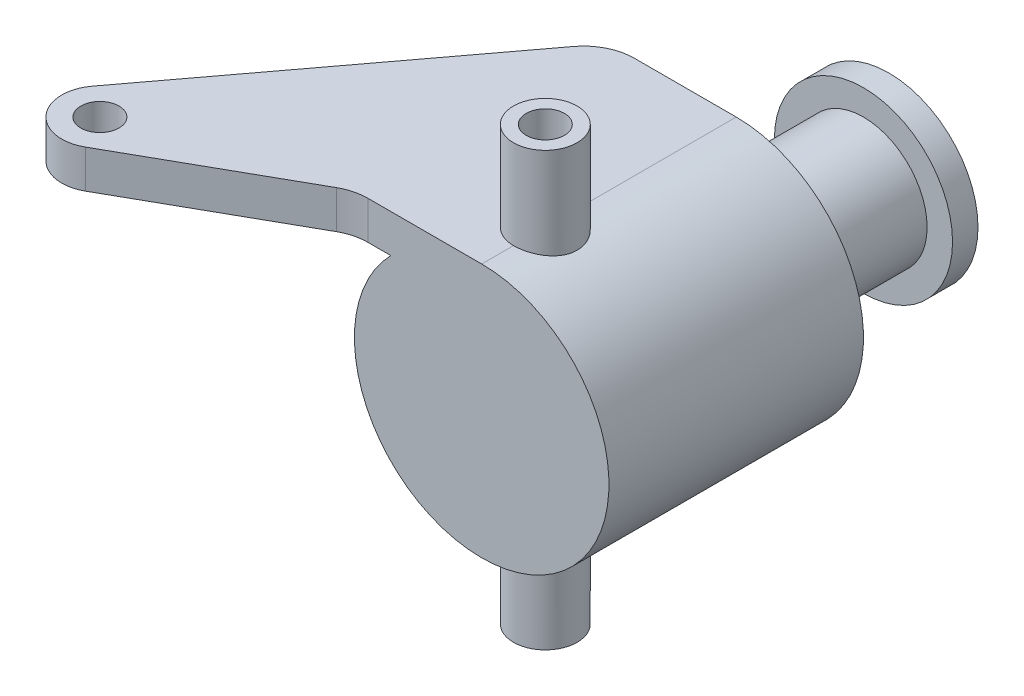
ISO-10303-21;
HEADER;
FILE_DESCRIPTION(('STEP AP214'),'2;1');
FILE_NAME('part.step','',(''),(''),'','','');
FILE_SCHEMA(('AUTOMOTIVE_DESIGN { 1 0 10303 214 1 1 1 1 }'));
ENDSEC;
DATA;
#1=APPLICATION_CONTEXT('core data for automotive mechanical design processes');
#2=APPLICATION_PROTOCOL_DEFINITION('international standard','automotive_design',2000,#1);
#3=PRODUCT_CONTEXT('',#1,'mechanical');
#4=PRODUCT('Part','Part','',(#3));
#5=PRODUCT_RELATED_PRODUCT_CATEGORY('part','',(#4));
#6=PRODUCT_DEFINITION_FORMATION('','',#4);
#7=PRODUCT_DEFINITION_CONTEXT('part definition',#1,'design');
#8=PRODUCT_DEFINITION('design','',#6,#7);
#9=PRODUCT_DEFINITION_SHAPE('','',#8);
#10=(LENGTH_UNIT() NAMED_UNIT(*) SI_UNIT(.MILLI.,.METRE.));
#11=(NAMED_UNIT(*) PLANE_ANGLE_UNIT() SI_UNIT($,.RADIAN.));
#12=(NAMED_UNIT(*) SI_UNIT($,.STERADIAN.) SOLID_ANGLE_UNIT());
#13=UNCERTAINTY_MEASURE_WITH_UNIT(LENGTH_MEASURE(1.E-05),#10,'distance_accuracy_value','');
#14=(GEOMETRIC_REPRESENTATION_CONTEXT(3) GLOBAL_UNCERTAINTY_ASSIGNED_CONTEXT((#13)) GLOBAL_UNIT_ASSIGNED_CONTEXT((#10,
#11,#12)) REPRESENTATION_CONTEXT('',''));
#15=CARTESIAN_POINT('',(0.,0.,0.));
#16=DIRECTION('',(0.,0.,1.));
#17=DIRECTION('',(1.,0.,0.));
#18=AXIS2_PLACEMENT_3D('',#15,#16,#17);
#19=CARTESIAN_POINT('',(0.,0.,12.7));
#20=DIRECTION('',(0.,0.,-1.));
#21=DIRECTION('',(-1.,0.,0.));
#22=AXIS2_PLACEMENT_3D('',#19,#20,#21);
#23=CYLINDRICAL_SURFACE('',#22,12.7);
#24=CARTESIAN_POINT('',(0.,-12.7,3.175));
#25=CARTESIAN_POINT('',(0.175421054350931,-12.699997033873,3.17500492281244));
#26=CARTESIAN_POINT('',(0.350897100741782,-12.6963292371237,3.18958711580452));
#27=CARTESIAN_POINT('',(0.696820051980961,-12.6820530760661,3.24744323693316));
#28=CARTESIAN_POINT('',(0.867264049209732,-12.6714407780562,3.29073342685512));
#29=CARTESIAN_POINT('',(1.19807751278645,-12.6444507573614,3.40452975316141));
#30=CARTESIAN_POINT('',(1.35845880926017,-12.6280799601569,3.47500320728065));
#31=CARTESIAN_POINT('',(1.6651226791977,-12.591316443928,3.64105060892825));
#32=CARTESIAN_POINT('',(1.81140477687155,-12.5709235892464,3.73662540311848));
#33=CARTESIAN_POINT('',(2.08873074612027,-12.5278602543576,3.95224167143468));
#34=CARTESIAN_POINT('',(2.2194428772959,-12.5051546346354,4.07270283366335));
#35=CARTESIAN_POINT('',(2.45903522924703,-12.4602582924964,4.33377383372412));
#36=CARTESIAN_POINT('',(2.56791298487579,-12.4380676284689,4.47438594357101));
#37=CARTESIAN_POINT('',(2.76230618225783,-12.3963594189446,4.77434322992663));
#38=CARTESIAN_POINT('',(2.84745052370821,-12.3768864828385,4.93393567187847));
#39=CARTESIAN_POINT('',(2.98957345643241,-12.3433309736481,5.26573413801374));
#40=CARTESIAN_POINT('',(3.04655655068163,-12.3292475388652,5.43793814055276));
#41=CARTESIAN_POINT('',(3.12960773790342,-12.3084267567389,5.78642373786018));
#42=CARTESIAN_POINT('',(3.15627230130285,-12.3015478927701,5.96255452994708));
#43=CARTESIAN_POINT('',(3.17978742389056,-12.2954915053947,6.31691347104861));
#44=CARTESIAN_POINT('',(3.176642833515,-12.2963127290579,6.49514127413169));
#45=CARTESIAN_POINT('',(3.14110481048738,-12.3054365167727,6.84406345972766));
#46=CARTESIAN_POINT('',(3.10942215340351,-12.3135572669878,7.01483573210162));
#47=CARTESIAN_POINT('',(3.01884119561133,-12.3360753547043,7.34856089109507));
#48=CARTESIAN_POINT('',(2.95994095604688,-12.3504731393489,7.51151321974455));
#49=CARTESIAN_POINT('',(2.81599106163371,-12.3840899110032,7.82687880106701));
#50=CARTESIAN_POINT('',(2.73068344564301,-12.4033560981112,7.97916906362126));
#51=CARTESIAN_POINT('',(2.53652078423164,-12.4445122129069,8.26752793565194));
#52=CARTESIAN_POINT('',(2.42766161831204,-12.4664025994163,8.40359370007568));
#53=CARTESIAN_POINT('',(2.18580424890858,-12.5111061380944,8.65971431988649));
#54=CARTESIAN_POINT('',(2.05220624645107,-12.5339278039511,8.77920200396319));
#55=CARTESIAN_POINT('',(1.76659522538283,-12.5773596047504,8.99418496321526));
#56=CARTESIAN_POINT('',(1.61458164448181,-12.5979696721292,9.08967950552455));
#57=CARTESIAN_POINT('',(1.29564529770894,-12.6347586626604,9.25417374084162));
#58=CARTESIAN_POINT('',(1.12867311562492,-12.6509221227036,9.32308130353854));
#59=CARTESIAN_POINT('',(0.785020883902435,-12.676884242985,9.43169163041859));
#60=CARTESIAN_POINT('',(0.608342698201858,-12.6866841206815,9.47139998108506));
#61=CARTESIAN_POINT('',(0.255142937325556,-12.6986347345775,9.51961851376621));
#62=CARTESIAN_POINT('',(0.0787330573083778,-12.7009747992586,9.52890107185939));
#63=CARTESIAN_POINT('',(-0.273119584996526,-12.6982813685726,9.51812294564922));
#64=CARTESIAN_POINT('',(-0.448562432914396,-12.6932485369526,9.49806490274183));
#65=CARTESIAN_POINT('',(-0.790816868910239,-12.6764961338623,9.42981157723825));
#66=CARTESIAN_POINT('',(-0.957717835150521,-12.6648767569325,9.38203765897374));
#67=CARTESIAN_POINT('',(-1.28112793569116,-12.6362609570897,9.26019000547309));
#68=CARTESIAN_POINT('',(-1.43763601861911,-12.6192639911647,9.18611361420368));
#69=CARTESIAN_POINT('',(-1.73889063454314,-12.5813250177716,9.0122668605486));
#70=CARTESIAN_POINT('',(-1.88337918521904,-12.5603183592593,8.91206389542726));
#71=CARTESIAN_POINT('',(-2.15376466554501,-12.5167921111412,8.68936135971267));
#72=CARTESIAN_POINT('',(-2.27965837982672,-12.4942722608556,8.56685794114268));
#73=CARTESIAN_POINT('',(-2.51246336908675,-12.4495762556412,8.29944584954746));
#74=CARTESIAN_POINT('',(-2.6188328531313,-12.4274221051899,8.15406102865081));
#75=CARTESIAN_POINT('',(-2.80566443991221,-12.3865825924258,7.84704925704162));
#76=CARTESIAN_POINT('',(-2.88612769264178,-12.3678970761539,7.68542302771299));
#77=CARTESIAN_POINT('',(-3.0182638402854,-12.3363163381503,7.35138288757303));
#78=CARTESIAN_POINT('',(-3.07010730622843,-12.3233869021911,7.17903985340403));
#79=CARTESIAN_POINT('',(-3.14398164687971,-12.3047494152553,6.82771126654123));
#80=CARTESIAN_POINT('',(-3.16601904149253,-12.2990397850061,6.64872717534393));
#81=CARTESIAN_POINT('',(-3.17931501621074,-12.2956087422145,6.2947104994796));
#82=CARTESIAN_POINT('',(-3.17143955029538,-12.2976625750886,6.11971209561251));
#83=CARTESIAN_POINT('',(-3.1271152390873,-12.3090074061495,5.77362343562374));
#84=CARTESIAN_POINT('',(-3.09066696801937,-12.3182982588945,5.6025331010331));
#85=CARTESIAN_POINT('',(-2.9907046261569,-12.3429450180985,5.27005876165632));
#86=CARTESIAN_POINT('',(-2.92735297324093,-12.3582644892528,5.10862303724463));
#87=CARTESIAN_POINT('',(-2.7755107337966,-12.3932474960913,4.79855660658629));
#88=CARTESIAN_POINT('',(-2.68701666057215,-12.4129116342002,4.64992768008686));
#89=CARTESIAN_POINT('',(-2.48468673461549,-12.4550092586012,4.36550936861324));
#90=CARTESIAN_POINT('',(-2.37025002816433,-12.4775016056119,4.23015606125285));
#91=CARTESIAN_POINT('',(-2.12045416901821,-12.5223699100401,3.98029208851616));
#92=CARTESIAN_POINT('',(-1.98509005500274,-12.5447458385544,3.86578637959415));
#93=CARTESIAN_POINT('',(-1.6943230585205,-12.5873437112106,3.65884606353831));
#94=CARTESIAN_POINT('',(-1.53860166056969,-12.6075193062447,3.56684873439517));
#95=CARTESIAN_POINT('',(-1.21341315929717,-12.6429542453063,3.41048453677586));
#96=CARTESIAN_POINT('',(-1.04395600927443,-12.658217110062,3.34609786996059));
#97=CARTESIAN_POINT('',(-0.72900170269868,-12.6798505941374,3.25633962580224));
#98=CARTESIAN_POINT('',(-0.585004695088743,-12.6873547169487,3.22590320220357));
#99=CARTESIAN_POINT('',(-0.294017851418465,-12.6974304774096,3.18523208600022));
#100=CARTESIAN_POINT('',(-0.147028241296871,-12.700002486044,3.17499587397045));
#101=CARTESIAN_POINT('',(0.,-12.7,3.175));
#102=B_SPLINE_CURVE_WITH_KNOTS('',3,(#24,#25,#26,#27,#28,#29,#30,#31,#32,#33,#34,#35,#36,#37,
#38,#39,#40,#41,#42,#43,#44,#45,#46,#47,#48,#49,#50,#51,#52,#53,#54,#55,#56,#57,#58,#59,#60,#61,
#62,#63,#64,#65,#66,#67,#68,#69,#70,#71,#72,#73,#74,#75,#76,#77,#78,#79,#80,#81,#82,#83,#84,#85,
#86,#87,#88,#89,#90,#91,#92,#93,#94,#95,#96,#97,#98,#99,#100,#101),.UNSPECIFIED.,.T.,.F.,(4,2,2,
2,2,2,2,2,2,2,2,2,2,2,2,2,2,2,2,2,2,2,2,2,2,2,2,2,2,2,2,2,2,2,2,2,2,2,4),(0.,0.5257243580655,
1.05174676993359,1.57713870983892,2.10254837335841,2.63767221675277,3.17285644277798,
3.71599137305291,4.25903942808496,4.79120824630598,5.3232904734557,5.84247618671884,
6.36169889010143,6.8861628400674,7.41071862276906,7.9502317705812,8.48976139571985,
9.0311441807632,9.57242335981323,10.09985087283,10.6272309069567,11.1467958106174,
11.6664131950588,12.1952509368702,12.7241800170734,13.266092111565,13.8079801469349,
14.34660272276,14.885107458967,15.4081433519175,15.9311687337377,16.4510804786766,
16.9710643590661,17.5046127008447,18.0382877269755,18.5816279265763,19.1245778677202,
19.5652441424438,20.005877269746),.UNSPECIFIED.);
#103=CARTESIAN_POINT('',(0.,-12.7,3.175));
#104=VERTEX_POINT('',#103);
#105=EDGE_CURVE('E11',#104,#104,#102,.T.);
#106=ORIENTED_EDGE('',*,*,#105,.F.);
#107=EDGE_LOOP('',(#106));
#108=FACE_BOUND('',#107,.T.);
#109=CARTESIAN_POINT('',(0.,12.7,3.175));
#110=CARTESIAN_POINT('',(-0.175421054350931,12.699997033873,3.17500492281244));
#111=CARTESIAN_POINT('',(-0.350897100741782,12.6963292371237,3.18958711580452));
#112=CARTESIAN_POINT('',(-0.696820051980961,12.6820530760661,3.24744323693316));
#113=CARTESIAN_POINT('',(-0.867264049209732,12.6714407780562,3.29073342685512));
#114=CARTESIAN_POINT('',(-1.19807751278645,12.6444507573614,3.40452975316141));
#115=CARTESIAN_POINT('',(-1.35845880926017,12.6280799601569,3.47500320728065));
#116=CARTESIAN_POINT('',(-1.6651226791977,12.591316443928,3.64105060892825));
#117=CARTESIAN_POINT('',(-1.81140477687155,12.5709235892464,3.73662540311848));
#118=CARTESIAN_POINT('',(-2.08873074612027,12.5278602543576,3.95224167143468));
#119=CARTESIAN_POINT('',(-2.2194428772959,12.5051546346354,4.07270283366335));
#120=CARTESIAN_POINT('',(-2.45903522924703,12.4602582924964,4.33377383372412));
#121=CARTESIAN_POINT('',(-2.56791298487579,12.4380676284689,4.47438594357101));
#122=CARTESIAN_POINT('',(-2.76230618225783,12.3963594189446,4.77434322992663));
#123=CARTESIAN_POINT('',(-2.84745052370821,12.3768864828385,4.93393567187847));
#124=CARTESIAN_POINT('',(-2.98957345643241,12.3433309736481,5.26573413801374));
#125=CARTESIAN_POINT('',(-3.04655655068163,12.3292475388652,5.43793814055276));
#126=CARTESIAN_POINT('',(-3.12960773790342,12.3084267567389,5.78642373786018));
#127=CARTESIAN_POINT('',(-3.15627230130285,12.3015478927701,5.96255452994708));
#128=CARTESIAN_POINT('',(-3.17978742389056,12.2954915053947,6.31691347104861));
#129=CARTESIAN_POINT('',(-3.176642833515,12.2963127290579,6.49514127413169));
#130=CARTESIAN_POINT('',(-3.14110481048738,12.3054365167727,6.84406345972766));
#131=CARTESIAN_POINT('',(-3.10942215340351,12.3135572669878,7.01483573210162));
#132=CARTESIAN_POINT('',(-3.01884119561133,12.3360753547043,7.34856089109507));
#133=CARTESIAN_POINT('',(-2.95994095604688,12.3504731393489,7.51151321974455));
#134=CARTESIAN_POINT('',(-2.81599106163371,12.3840899110032,7.82687880106701));
#135=CARTESIAN_POINT('',(-2.73068344564301,12.4033560981112,7.97916906362126));
#136=CARTESIAN_POINT('',(-2.53652078423164,12.4445122129069,8.26752793565194));
#137=CARTESIAN_POINT('',(-2.42766161831204,12.4664025994163,8.40359370007568));
#138=CARTESIAN_POINT('',(-2.18580424890858,12.5111061380944,8.65971431988649));
#139=CARTESIAN_POINT('',(-2.05220624645107,12.5339278039511,8.77920200396319));
#140=CARTESIAN_POINT('',(-1.76659522538283,12.5773596047504,8.99418496321526));
#141=CARTESIAN_POINT('',(-1.61458164448181,12.5979696721292,9.08967950552455));
#142=CARTESIAN_POINT('',(-1.29564529770894,12.6347586626604,9.25417374084162));
#143=CARTESIAN_POINT('',(-1.12867311562492,12.6509221227036,9.32308130353854));
#144=CARTESIAN_POINT('',(-0.785020883902435,12.676884242985,9.43169163041859));
#145=CARTESIAN_POINT('',(-0.608342698201858,12.6866841206815,9.47139998108506));
#146=CARTESIAN_POINT('',(-0.255142937325556,12.6986347345775,9.51961851376621));
#147=CARTESIAN_POINT('',(-0.0787330573083778,12.7009747992586,9.52890107185939));
#148=CARTESIAN_POINT('',(0.273119584996526,12.6982813685726,9.51812294564922));
#149=CARTESIAN_POINT('',(0.448562432914396,12.6932485369526,9.49806490274183));
#150=CARTESIAN_POINT('',(0.790816868910239,12.6764961338623,9.42981157723825));
#151=CARTESIAN_POINT('',(0.957717835150521,12.6648767569325,9.38203765897374));
#152=CARTESIAN_POINT('',(1.28112793569116,12.6362609570897,9.26019000547309));
#153=CARTESIAN_POINT('',(1.43763601861911,12.6192639911647,9.18611361420368));
#154=CARTESIAN_POINT('',(1.73889063454314,12.5813250177716,9.0122668605486));
#155=CARTESIAN_POINT('',(1.88337918521904,12.5603183592593,8.91206389542726));
#156=CARTESIAN_POINT('',(2.15376466554501,12.5167921111412,8.68936135971267));
#157=CARTESIAN_POINT('',(2.27965837982672,12.4942722608556,8.56685794114268));
#158=CARTESIAN_POINT('',(2.51246336908675,12.4495762556412,8.29944584954746));
#159=CARTESIAN_POINT('',(2.6188328531313,12.4274221051899,8.15406102865081));
#160=CARTESIAN_POINT('',(2.80566443991221,12.3865825924258,7.84704925704162));
#161=CARTESIAN_POINT('',(2.88612769264178,12.3678970761539,7.68542302771299));
#162=CARTESIAN_POINT('',(3.0182638402854,12.3363163381503,7.35138288757303));
#163=CARTESIAN_POINT('',(3.07010730622843,12.3233869021911,7.17903985340403));
#164=CARTESIAN_POINT('',(3.14398164687971,12.3047494152553,6.82771126654123));
#165=CARTESIAN_POINT('',(3.16601904149253,12.2990397850061,6.64872717534393));
#166=CARTESIAN_POINT('',(3.17931501621074,12.2956087422145,6.2947104994796));
#167=CARTESIAN_POINT('',(3.17143955029538,12.2976625750886,6.11971209561251));
#168=CARTESIAN_POINT('',(3.1271152390873,12.3090074061495,5.77362343562374));
#169=CARTESIAN_POINT('',(3.09066696801937,12.3182982588945,5.6025331010331));
#170=CARTESIAN_POINT('',(2.9907046261569,12.3429450180985,5.27005876165632));
#171=CARTESIAN_POINT('',(2.92735297324093,12.3582644892528,5.10862303724463));
#172=CARTESIAN_POINT('',(2.7755107337966,12.3932474960913,4.79855660658629));
#173=CARTESIAN_POINT('',(2.68701666057215,12.4129116342002,4.64992768008686));
#174=CARTESIAN_POINT('',(2.48468673461549,12.4550092586012,4.36550936861324));
#175=CARTESIAN_POINT('',(2.37025002816433,12.4775016056119,4.23015606125285));
#176=CARTESIAN_POINT('',(2.12045416901821,12.5223699100401,3.98029208851616));
#177=CARTESIAN_POINT('',(1.98509005500274,12.5447458385544,3.86578637959415));
#178=CARTESIAN_POINT('',(1.6943230585205,12.5873437112106,3.65884606353831));
#179=CARTESIAN_POINT('',(1.53860166056969,12.6075193062447,3.56684873439517));
#180=CARTESIAN_POINT('',(1.21341315929717,12.6429542453063,3.41048453677586));
#181=CARTESIAN_POINT('',(1.04395600927443,12.658217110062,3.34609786996059));
#182=CARTESIAN_POINT('',(0.72900170269868,12.6798505941374,3.25633962580224));
#183=CARTESIAN_POINT('',(0.585004695088743,12.6873547169487,3.22590320220357));
#184=CARTESIAN_POINT('',(0.294017851418465,12.6974304774096,3.18523208600022));
#185=CARTESIAN_POINT('',(0.147028241296871,12.700002486044,3.17499587397045));
#186=CARTESIAN_POINT('',(0.,12.7,3.175));
#187=B_SPLINE_CURVE_WITH_KNOTS('',3,(#109,#110,#111,#112,#113,#114,#115,#116,#117,#118,#119,
#120,#121,#122,#123,#124,#125,#126,#127,#128,#129,#130,#131,#132,#133,#134,#135,#136,#137,#138,
#139,#140,#141,#142,#143,#144,#145,#146,#147,#148,#149,#150,#151,#152,#153,#154,#155,#156,#157,
#158,#159,#160,#161,#162,#163,#164,#165,#166,#167,#168,#169,#170,#171,#172,#173,#174,#175,#176,
#177,#178,#179,#180,#181,#182,#183,#184,#185,#186),.UNSPECIFIED.,.T.,.F.,(4,2,2,2,2,2,2,2,2,2,2,
2,2,2,2,2,2,2,2,2,2,2,2,2,2,2,2,2,2,2,2,2,2,2,2,2,2,2,4),(0.,0.5257243580655,1.05174676993359,
1.57713870983892,2.10254837335841,2.63767221675277,3.17285644277798,3.71599137305291,
4.25903942808496,4.79120824630598,5.3232904734557,5.84247618671884,6.36169889010143,
6.8861628400674,7.41071862276906,7.9502317705812,8.48976139571985,9.0311441807632,
9.57242335981323,10.09985087283,10.6272309069567,11.1467958106174,11.6664131950588,
12.1952509368702,12.7241800170734,13.266092111565,13.8079801469349,14.34660272276,
14.885107458967,15.4081433519175,15.9311687337377,16.4510804786766,16.9710643590661,
17.5046127008447,18.0382877269755,18.5816279265763,19.1245778677202,19.5652441424438,
20.005877269746),.UNSPECIFIED.);
#188=CARTESIAN_POINT('',(0.,12.7,9.525));
#189=VERTEX_POINT('',#188);
#190=CARTESIAN_POINT('',(0.,12.7,3.175));
#191=VERTEX_POINT('',#190);
#192=EDGE_CURVE('E123',#189,#191,#187,.T.);
#193=ORIENTED_EDGE('',*,*,#192,.F.);
#194=DIRECTION('',(0.,0.,-1.));
#195=VECTOR('',#194,1.);
#196=CARTESIAN_POINT('',(0.,12.7,-12.7));
#197=LINE('',#196,#195);
#198=CARTESIAN_POINT('',(0.,12.7,12.7));
#199=VERTEX_POINT('',#198);
#200=EDGE_CURVE('E111',#199,#189,#197,.T.);
#201=ORIENTED_EDGE('',*,*,#200,.F.);
#202=CARTESIAN_POINT('',(0.,0.,12.7));
#203=DIRECTION('',(0.,0.,1.));
#204=DIRECTION('',(1.,0.,0.));
#205=AXIS2_PLACEMENT_3D('',#202,#203,#204);
#206=CIRCLE('',#205,12.7);
#207=CARTESIAN_POINT('',(-9.06961410424948,8.89,12.7));
#208=VERTEX_POINT('',#207);
#209=EDGE_CURVE('E65',#208,#199,#206,.T.);
#210=ORIENTED_EDGE('',*,*,#209,.F.);
#211=DIRECTION('',(0.,0.,-1.));
#212=VECTOR('',#211,1.);
#213=CARTESIAN_POINT('',(-9.06961410424948,8.89,12.7));
#214=LINE('',#213,#212);
#215=CARTESIAN_POINT('',(-9.06961410424948,8.89,-12.7));
#216=VERTEX_POINT('',#215);
#217=EDGE_CURVE('E142',#208,#216,#214,.T.);
#218=ORIENTED_EDGE('',*,*,#217,.T.);
#219=CARTESIAN_POINT('',(0.,0.,-12.7));
#220=DIRECTION('',(0.,0.,1.));
#221=DIRECTION('',(1.,0.,0.));
#222=AXIS2_PLACEMENT_3D('',#219,#220,#221);
#223=CIRCLE('',#222,12.7);
#224=CARTESIAN_POINT('',(0.,12.7,-12.7));
#225=VERTEX_POINT('',#224);
#226=EDGE_CURVE('E138',#216,#225,#223,.T.);
#227=ORIENTED_EDGE('',*,*,#226,.T.);
#228=EDGE_CURVE('E120',#191,#225,#197,.T.);
#229=ORIENTED_EDGE('',*,*,#228,.F.);
#230=EDGE_LOOP('',(#193,#201,#210,#218,#227,#229));
#231=FACE_BOUND('',#230,.T.);
#232=ADVANCED_FACE('F41',(#108,#231),#23,.T.);
#233=CARTESIAN_POINT('',(0.,0.,12.7));
#234=DIRECTION('',(0.,0.,1.));
#235=DIRECTION('',(1.,0.,0.));
#236=AXIS2_PLACEMENT_3D('',#233,#234,#235);
#237=PLANE('',#236);
#238=ORIENTED_EDGE('',*,*,#209,.T.);
#239=DIRECTION('',(1.,0.,0.));
#240=VECTOR('',#239,1.);
#241=CARTESIAN_POINT('',(0.,12.7,12.7));
#242=LINE('',#241,#240);
#243=CARTESIAN_POINT('',(-11.3685962714996,12.7,12.7));
#244=VERTEX_POINT('',#243);
#245=EDGE_CURVE('E117',#244,#199,#242,.T.);
#246=ORIENTED_EDGE('',*,*,#245,.F.);
#247=DIRECTION('',(0.,1.,0.));
#248=VECTOR('',#247,1.);
#249=CARTESIAN_POINT('',(-11.3685962714996,8.89,12.7));
#250=LINE('',#249,#248);
#251=CARTESIAN_POINT('',(-11.3685962714996,8.89,12.7));
#252=VERTEX_POINT('',#251);
#253=EDGE_CURVE('E146',#252,#244,#250,.T.);
#254=ORIENTED_EDGE('',*,*,#253,.F.);
#255=DIRECTION('',(1.,0.,0.));
#256=VECTOR('',#255,1.);
#257=CARTESIAN_POINT('',(0.,8.89,12.7));
#258=LINE('',#257,#256);
#259=EDGE_CURVE('E151',#252,#208,#258,.T.);
#260=ORIENTED_EDGE('',*,*,#259,.T.);
#261=EDGE_LOOP('',(#238,#246,#254,#260));
#262=FACE_BOUND('',#261,.T.);
#263=ADVANCED_FACE('F298',(#262),#237,.T.);
#264=CARTESIAN_POINT('',(0.,0.,-12.7));
#265=DIRECTION('',(0.,0.,1.));
#266=DIRECTION('',(1.,0.,0.));
#267=AXIS2_PLACEMENT_3D('',#264,#265,#266);
#268=PLANE('',#267);
#269=CARTESIAN_POINT('',(0.,0.,-12.7));
#270=DIRECTION('',(0.,0.,1.));
#271=DIRECTION('',(1.,0.,0.));
#272=AXIS2_PLACEMENT_3D('',#269,#270,#271);
#273=CIRCLE('',#272,6.35);
#274=CARTESIAN_POINT('',(6.35,0.,-12.7));
#275=VERTEX_POINT('',#274);
#276=EDGE_CURVE('E132',#275,#275,#273,.F.);
#277=ORIENTED_EDGE('',*,*,#276,.F.);
#278=EDGE_LOOP('',(#277));
#279=FACE_BOUND('',#278,.T.);
#280=ORIENTED_EDGE('',*,*,#226,.F.);
#281=DIRECTION('',(-1.,0.,0.));
#282=VECTOR('',#281,1.);
#283=CARTESIAN_POINT('',(-10.16,8.89,-12.7));
#284=LINE('',#283,#282);
#285=CARTESIAN_POINT('',(-10.16,8.89,-12.7));
#286=VERTEX_POINT('',#285);
#287=EDGE_CURVE('E119',#216,#286,#284,.T.);
#288=ORIENTED_EDGE('',*,*,#287,.T.);
#289=DIRECTION('',(0.,1.,0.));
#290=VECTOR('',#289,1.);
#291=CARTESIAN_POINT('',(-10.16,8.89,-12.7));
#292=LINE('',#291,#290);
#293=CARTESIAN_POINT('',(-10.16,12.7,-12.7));
#294=VERTEX_POINT('',#293);
#295=EDGE_CURVE('E147',#286,#294,#292,.T.);
#296=ORIENTED_EDGE('',*,*,#295,.T.);
#297=DIRECTION('',(-1.,0.,0.));
#298=VECTOR('',#297,1.);
#299=CARTESIAN_POINT('',(-10.16,12.7,-12.7));
#300=LINE('',#299,#298);
#301=EDGE_CURVE('E186',#225,#294,#300,.T.);
#302=ORIENTED_EDGE('',*,*,#301,.F.);
#303=EDGE_LOOP('',(#280,#288,#296,#302));
#304=FACE_BOUND('',#303,.T.);
#305=ADVANCED_FACE('F275',(#279,#304),#268,.F.);
#306=CARTESIAN_POINT('',(-11.3685962714996,8.89,17.78));
#307=DIRECTION('',(0.,-1.,0.));
#308=DIRECTION('',(0.,0.,-1.));
#309=AXIS2_PLACEMENT_3D('',#306,#307,#308);
#310=PLANE('',#309);
#311=CARTESIAN_POINT('',(-31.75,8.89,19.05));
#312=DIRECTION('',(0.,1.,0.));
#313=DIRECTION('',(0.,0.,1.));
#314=AXIS2_PLACEMENT_3D('',#311,#312,#313);
#315=CIRCLE('',#314,1.905);
#316=CARTESIAN_POINT('',(-31.75,8.89,20.955));
#317=VERTEX_POINT('',#316);
#318=EDGE_CURVE('E190',#317,#317,#315,.T.);
#319=ORIENTED_EDGE('',*,*,#318,.T.);
#320=EDGE_LOOP('',(#319));
#321=FACE_BOUND('',#320,.T.);
#322=ORIENTED_EDGE('',*,*,#217,.F.);
#323=ORIENTED_EDGE('',*,*,#259,.F.);
#324=CARTESIAN_POINT('',(-11.3685962714996,8.89,17.78));
#325=DIRECTION('',(0.,-1.,0.));
#326=DIRECTION('',(0.,0.,-1.));
#327=AXIS2_PLACEMENT_3D('',#324,#325,#326);
#328=CIRCLE('',#327,5.08);
#329=CARTESIAN_POINT('',(-13.8602524206396,8.89,13.35303155258));
#330=VERTEX_POINT('',#329);
#331=EDGE_CURVE('E194',#330,#252,#328,.T.);
#332=ORIENTED_EDGE('',*,*,#331,.F.);
#333=DIRECTION('',(0.871450481775601,0.,-0.490483493925202));
#334=VECTOR('',#333,1.);
#335=CARTESIAN_POINT('',(-13.8602524206396,8.89,13.35303155258));
#336=LINE('',#335,#334);
#337=CARTESIAN_POINT('',(-29.881257888145,8.89,22.370226335565));
#338=VERTEX_POINT('',#337);
#339=EDGE_CURVE('E198',#338,#330,#336,.T.);
#340=ORIENTED_EDGE('',*,*,#339,.F.);
#341=CARTESIAN_POINT('',(-31.75,8.89,19.05));
#342=DIRECTION('',(0.,1.,0.));
#343=DIRECTION('',(0.,0.,-1.));
#344=AXIS2_PLACEMENT_3D('',#341,#342,#343);
#345=CIRCLE('',#344,3.81);
#346=CARTESIAN_POINT('',(-34.798,8.89,16.764));
#347=VERTEX_POINT('',#346);
#348=EDGE_CURVE('E202',#347,#338,#345,.T.);
#349=ORIENTED_EDGE('',*,*,#348,.F.);
#350=DIRECTION('',(-0.599999999999999,0.,0.800000000000001));
#351=VECTOR('',#350,1.);
#352=CARTESIAN_POINT('',(-34.798,8.89,16.764));
#353=LINE('',#352,#351);
#354=CARTESIAN_POINT('',(-14.2240000000001,8.89,-10.668));
#355=VERTEX_POINT('',#354);
#356=EDGE_CURVE('E206',#355,#347,#353,.T.);
#357=ORIENTED_EDGE('',*,*,#356,.F.);
#358=CARTESIAN_POINT('',(-10.16,8.89,-7.62));
#359=DIRECTION('',(0.,1.,0.));
#360=DIRECTION('',(0.,0.,1.));
#361=AXIS2_PLACEMENT_3D('',#358,#359,#360);
#362=CIRCLE('',#361,5.08);
#363=EDGE_CURVE('E210',#286,#355,#362,.T.);
#364=ORIENTED_EDGE('',*,*,#363,.F.);
#365=ORIENTED_EDGE('',*,*,#287,.F.);
#366=EDGE_LOOP('',(#322,#323,#332,#340,#349,#357,#364,#365));
#367=FACE_BOUND('',#366,.T.);
#368=ADVANCED_FACE('F271',(#321,#367),#310,.T.);
#369=CARTESIAN_POINT('',(-11.3685962714996,8.89,17.78));
#370=DIRECTION('',(0.,1.,0.));
#371=DIRECTION('',(0.,0.,1.));
#372=AXIS2_PLACEMENT_3D('',#369,#370,#371);
#373=CYLINDRICAL_SURFACE('',#372,5.08);
#374=CARTESIAN_POINT('',(-11.3685962714996,12.7,17.78));
#375=DIRECTION('',(0.,-1.,0.));
#376=DIRECTION('',(0.,0.,-1.));
#377=AXIS2_PLACEMENT_3D('',#374,#375,#376);
#378=CIRCLE('',#377,5.08);
#379=CARTESIAN_POINT('',(-13.8602524206396,12.7,13.35303155258));
#380=VERTEX_POINT('',#379);
#381=EDGE_CURVE('E167',#380,#244,#378,.T.);
#382=ORIENTED_EDGE('',*,*,#381,.F.);
#383=DIRECTION('',(0.,1.,0.));
#384=VECTOR('',#383,1.);
#385=CARTESIAN_POINT('',(-13.8602524206396,8.89,13.35303155258));
#386=LINE('',#385,#384);
#387=EDGE_CURVE('E160',#330,#380,#386,.T.);
#388=ORIENTED_EDGE('',*,*,#387,.F.);
#389=ORIENTED_EDGE('',*,*,#331,.T.);
#390=ORIENTED_EDGE('',*,*,#253,.T.);
#391=EDGE_LOOP('',(#382,#388,#389,#390));
#392=FACE_BOUND('',#391,.T.);
#393=ADVANCED_FACE('F274',(#392),#373,.F.);
#394=CARTESIAN_POINT('',(-13.8602524206396,8.89,13.35303155258));
#395=DIRECTION('',(0.490483493925202,0.,0.871450481775601));
#396=DIRECTION('',(0.871450481775601,0.,-0.490483493925202));
#397=AXIS2_PLACEMENT_3D('',#394,#395,#396);
#398=PLANE('',#397);
#399=DIRECTION('',(0.871450481775601,0.,-0.490483493925202));
#400=VECTOR('',#399,1.);
#401=CARTESIAN_POINT('',(-13.8602524206396,12.7,13.35303155258));
#402=LINE('',#401,#400);
#403=CARTESIAN_POINT('',(-29.881257888145,12.7,22.370226335565));
#404=VERTEX_POINT('',#403);
#405=EDGE_CURVE('E170',#404,#380,#402,.T.);
#406=ORIENTED_EDGE('',*,*,#405,.F.);
#407=DIRECTION('',(0.,1.,0.));
#408=VECTOR('',#407,1.);
#409=CARTESIAN_POINT('',(-29.881257888145,8.89,22.370226335565));
#410=LINE('',#409,#408);
#411=EDGE_CURVE('E157',#338,#404,#410,.T.);
#412=ORIENTED_EDGE('',*,*,#411,.F.);
#413=ORIENTED_EDGE('',*,*,#339,.T.);
#414=ORIENTED_EDGE('',*,*,#387,.T.);
#415=EDGE_LOOP('',(#406,#412,#413,#414));
#416=FACE_BOUND('',#415,.T.);
#417=ADVANCED_FACE('F282',(#416),#398,.T.);
#418=CARTESIAN_POINT('',(-31.75,8.89,19.05));
#419=DIRECTION('',(0.,1.,0.));
#420=DIRECTION('',(0.,0.,1.));
#421=AXIS2_PLACEMENT_3D('',#418,#419,#420);
#422=CYLINDRICAL_SURFACE('',#421,3.81);
#423=CARTESIAN_POINT('',(-31.75,12.7,19.05));
#424=DIRECTION('',(0.,1.,0.));
#425=DIRECTION('',(0.,0.,-1.));
#426=AXIS2_PLACEMENT_3D('',#423,#424,#425);
#427=CIRCLE('',#426,3.81);
#428=CARTESIAN_POINT('',(-34.798,12.7,16.764));
#429=VERTEX_POINT('',#428);
#430=EDGE_CURVE('E174',#429,#404,#427,.T.);
#431=ORIENTED_EDGE('',*,*,#430,.F.);
#432=DIRECTION('',(0.,1.,0.));
#433=VECTOR('',#432,1.);
#434=CARTESIAN_POINT('',(-34.798,8.89,16.764));
#435=LINE('',#434,#433);
#436=EDGE_CURVE('E154',#347,#429,#435,.T.);
#437=ORIENTED_EDGE('',*,*,#436,.F.);
#438=ORIENTED_EDGE('',*,*,#348,.T.);
#439=ORIENTED_EDGE('',*,*,#411,.T.);
#440=EDGE_LOOP('',(#431,#437,#438,#439));
#441=FACE_BOUND('',#440,.T.);
#442=ADVANCED_FACE('F286',(#441),#422,.T.);
#443=CARTESIAN_POINT('',(-34.798,8.89,16.764));
#444=DIRECTION('',(-0.800000000000001,0.,-0.599999999999999));
#445=DIRECTION('',(-0.599999999999999,0.,0.800000000000001));
#446=AXIS2_PLACEMENT_3D('',#443,#444,#445);
#447=PLANE('',#446);
#448=DIRECTION('',(-0.599999999999999,0.,0.800000000000001));
#449=VECTOR('',#448,1.);
#450=CARTESIAN_POINT('',(-34.798,12.7,16.764));
#451=LINE('',#450,#449);
#452=CARTESIAN_POINT('',(-14.2240000000001,12.7,-10.668));
#453=VERTEX_POINT('',#452);
#454=EDGE_CURVE('E178',#453,#429,#451,.T.);
#455=ORIENTED_EDGE('',*,*,#454,.F.);
#456=DIRECTION('',(0.,1.,0.));
#457=VECTOR('',#456,1.);
#458=CARTESIAN_POINT('',(-14.2240000000001,8.89,-10.668));
#459=LINE('',#458,#457);
#460=EDGE_CURVE('E150',#355,#453,#459,.T.);
#461=ORIENTED_EDGE('',*,*,#460,.F.);
#462=ORIENTED_EDGE('',*,*,#356,.T.);
#463=ORIENTED_EDGE('',*,*,#436,.T.);
#464=EDGE_LOOP('',(#455,#461,#462,#463));
#465=FACE_BOUND('',#464,.T.);
#466=ADVANCED_FACE('F290',(#465),#447,.T.);
#467=CARTESIAN_POINT('',(-10.16,8.89,-7.62));
#468=DIRECTION('',(0.,1.,0.));
#469=DIRECTION('',(0.,0.,1.));
#470=AXIS2_PLACEMENT_3D('',#467,#468,#469);
#471=CYLINDRICAL_SURFACE('',#470,5.08);
#472=CARTESIAN_POINT('',(-10.16,12.7,-7.62));
#473=DIRECTION('',(0.,1.,0.));
#474=DIRECTION('',(0.,0.,1.));
#475=AXIS2_PLACEMENT_3D('',#472,#473,#474);
#476=CIRCLE('',#475,5.08);
#477=EDGE_CURVE('E182',#294,#453,#476,.T.);
#478=ORIENTED_EDGE('',*,*,#477,.F.);
#479=ORIENTED_EDGE('',*,*,#295,.F.);
#480=ORIENTED_EDGE('',*,*,#363,.T.);
#481=ORIENTED_EDGE('',*,*,#460,.T.);
#482=EDGE_LOOP('',(#478,#479,#480,#481));
#483=FACE_BOUND('',#482,.T.);
#484=ADVANCED_FACE('F279',(#483),#471,.T.);
#485=CARTESIAN_POINT('',(-11.3685962714996,12.7,17.78));
#486=DIRECTION('',(0.,-1.,0.));
#487=DIRECTION('',(0.,0.,-1.));
#488=AXIS2_PLACEMENT_3D('',#485,#486,#487);
#489=PLANE('',#488);
#490=CARTESIAN_POINT('',(0.,12.7,6.35));
#491=DIRECTION('',(0.,-1.,0.));
#492=DIRECTION('',(0.,0.,-1.));
#493=AXIS2_PLACEMENT_3D('',#490,#491,#492);
#494=CIRCLE('',#493,3.175);
#495=EDGE_CURVE('E45',#191,#189,#494,.F.);
#496=ORIENTED_EDGE('',*,*,#495,.F.);
#497=ORIENTED_EDGE('',*,*,#228,.T.);
#498=ORIENTED_EDGE('',*,*,#301,.T.);
#499=ORIENTED_EDGE('',*,*,#477,.T.);
#500=ORIENTED_EDGE('',*,*,#454,.T.);
#501=ORIENTED_EDGE('',*,*,#430,.T.);
#502=ORIENTED_EDGE('',*,*,#405,.T.);
#503=ORIENTED_EDGE('',*,*,#381,.T.);
#504=ORIENTED_EDGE('',*,*,#245,.T.);
#505=ORIENTED_EDGE('',*,*,#200,.T.);
#506=EDGE_LOOP('',(#496,#497,#498,#499,#500,#501,#502,#503,#504,#505));
#507=FACE_BOUND('',#506,.T.);
#508=CARTESIAN_POINT('',(-31.75,12.7,19.05));
#509=DIRECTION('',(0.,1.,0.));
#510=DIRECTION('',(0.,0.,1.));
#511=AXIS2_PLACEMENT_3D('',#508,#509,#510);
#512=CIRCLE('',#511,1.905);
#513=CARTESIAN_POINT('',(-31.75,12.7,20.955));
#514=VERTEX_POINT('',#513);
#515=EDGE_CURVE('E216',#514,#514,#512,.T.);
#516=ORIENTED_EDGE('',*,*,#515,.F.);
#517=EDGE_LOOP('',(#516));
#518=FACE_BOUND('',#517,.T.);
#519=ADVANCED_FACE('F113',(#507,#518),#489,.F.);
#520=CARTESIAN_POINT('',(-31.75,8.89,19.05));
#521=DIRECTION('',(0.,1.,0.));
#522=DIRECTION('',(0.,0.,1.));
#523=AXIS2_PLACEMENT_3D('',#520,#521,#522);
#524=CYLINDRICAL_SURFACE('',#523,1.905);
#525=ORIENTED_EDGE('',*,*,#318,.F.);
#526=EDGE_LOOP('',(#525));
#527=FACE_BOUND('',#526,.T.);
#528=ORIENTED_EDGE('',*,*,#515,.T.);
#529=EDGE_LOOP('',(#528));
#530=FACE_BOUND('',#529,.T.);
#531=ADVANCED_FACE('F266',(#527,#530),#524,.F.);
#532=CARTESIAN_POINT('',(0.,0.,-25.4));
#533=DIRECTION('',(0.,0.,1.));
#534=DIRECTION('',(1.,0.,0.));
#535=AXIS2_PLACEMENT_3D('',#532,#533,#534);
#536=CYLINDRICAL_SURFACE('',#535,6.35);
#537=CARTESIAN_POINT('',(0.,0.,-25.4));
#538=DIRECTION('',(0.,0.,-1.));
#539=DIRECTION('',(-1.,0.,0.));
#540=AXIS2_PLACEMENT_3D('',#537,#538,#539);
#541=CIRCLE('',#540,6.35);
#542=CARTESIAN_POINT('',(-6.35,0.,-25.4));
#543=VERTEX_POINT('',#542);
#544=EDGE_CURVE('E220',#543,#543,#541,.T.);
#545=ORIENTED_EDGE('',*,*,#544,.F.);
#546=EDGE_LOOP('',(#545));
#547=FACE_BOUND('',#546,.T.);
#548=ORIENTED_EDGE('',*,*,#276,.T.);
#549=EDGE_LOOP('',(#548));
#550=FACE_BOUND('',#549,.T.);
#551=ADVANCED_FACE('F262',(#547,#550),#536,.T.);
#552=CARTESIAN_POINT('',(0.,0.,-27.94));
#553=DIRECTION('',(0.,0.,1.));
#554=DIRECTION('',(1.,0.,0.));
#555=AXIS2_PLACEMENT_3D('',#552,#553,#554);
#556=CYLINDRICAL_SURFACE('',#555,8.89);
#557=CARTESIAN_POINT('',(0.,0.,-27.94));
#558=DIRECTION('',(0.,0.,-1.));
#559=DIRECTION('',(-1.,0.,0.));
#560=AXIS2_PLACEMENT_3D('',#557,#558,#559);
#561=CIRCLE('',#560,8.89);
#562=CARTESIAN_POINT('',(-8.89,0.,-27.94));
#563=VERTEX_POINT('',#562);
#564=EDGE_CURVE('E227',#563,#563,#561,.T.);
#565=ORIENTED_EDGE('',*,*,#564,.F.);
#566=EDGE_LOOP('',(#565));
#567=FACE_BOUND('',#566,.T.);
#568=CARTESIAN_POINT('',(0.,0.,-25.4));
#569=DIRECTION('',(0.,0.,-1.));
#570=DIRECTION('',(-1.,0.,0.));
#571=AXIS2_PLACEMENT_3D('',#568,#569,#570);
#572=CIRCLE('',#571,8.89);
#573=CARTESIAN_POINT('',(-8.89,0.,-25.4));
#574=VERTEX_POINT('',#573);
#575=EDGE_CURVE('E127',#574,#574,#572,.T.);
#576=ORIENTED_EDGE('',*,*,#575,.T.);
#577=EDGE_LOOP('',(#576));
#578=FACE_BOUND('',#577,.T.);
#579=ADVANCED_FACE('F254',(#567,#578),#556,.T.);
#580=CARTESIAN_POINT('',(0.,0.,-27.94));
#581=DIRECTION('',(0.,0.,-1.));
#582=DIRECTION('',(-1.,0.,0.));
#583=AXIS2_PLACEMENT_3D('',#580,#581,#582);
#584=PLANE('',#583);
#585=ORIENTED_EDGE('',*,*,#564,.T.);
#586=EDGE_LOOP('',(#585));
#587=FACE_BOUND('',#586,.T.);
#588=ADVANCED_FACE('F249',(#587),#584,.T.);
#589=CARTESIAN_POINT('',(0.,0.,-25.4));
#590=DIRECTION('',(0.,0.,-1.));
#591=DIRECTION('',(-1.,0.,0.));
#592=AXIS2_PLACEMENT_3D('',#589,#590,#591);
#593=PLANE('',#592);
#594=ORIENTED_EDGE('',*,*,#544,.T.);
#595=EDGE_LOOP('',(#594));
#596=FACE_BOUND('',#595,.T.);
#597=ORIENTED_EDGE('',*,*,#575,.F.);
#598=EDGE_LOOP('',(#597));
#599=FACE_BOUND('',#598,.T.);
#600=ADVANCED_FACE('F253',(#596,#599),#593,.F.);
#601=CARTESIAN_POINT('',(0.,21.59,6.35));
#602=DIRECTION('',(0.,1.,0.));
#603=DIRECTION('',(0.,0.,1.));
#604=AXIS2_PLACEMENT_3D('',#601,#602,#603);
#605=PLANE('',#604);
#606=CARTESIAN_POINT('',(0.,21.59,6.35));
#607=DIRECTION('',(0.,1.,0.));
#608=DIRECTION('',(0.,0.,1.));
#609=AXIS2_PLACEMENT_3D('',#606,#607,#608);
#610=CIRCLE('',#609,1.905);
#611=CARTESIAN_POINT('',(0.,21.59,8.255));
#612=VERTEX_POINT('',#611);
#613=EDGE_CURVE('E442',#612,#612,#610,.T.);
#614=ORIENTED_EDGE('',*,*,#613,.F.);
#615=EDGE_LOOP('',(#614));
#616=FACE_BOUND('',#615,.T.);
#617=CARTESIAN_POINT('',(0.,21.59,6.35));
#618=DIRECTION('',(0.,1.,0.));
#619=DIRECTION('',(0.,0.,1.));
#620=AXIS2_PLACEMENT_3D('',#617,#618,#619);
#621=CIRCLE('',#620,3.175);
#622=CARTESIAN_POINT('',(0.,21.59,9.525));
#623=VERTEX_POINT('',#622);
#624=EDGE_CURVE('E128',#623,#623,#621,.T.);
#625=ORIENTED_EDGE('',*,*,#624,.T.);
#626=EDGE_LOOP('',(#625));
#627=FACE_BOUND('',#626,.T.);
#628=ADVANCED_FACE('F258',(#616,#627),#605,.T.);
#629=CARTESIAN_POINT('',(0.,21.59,6.35));
#630=DIRECTION('',(0.,-1.,0.));
#631=DIRECTION('',(0.,0.,-1.));
#632=AXIS2_PLACEMENT_3D('',#629,#630,#631);
#633=CYLINDRICAL_SURFACE('',#632,3.175);
#634=ORIENTED_EDGE('',*,*,#624,.F.);
#635=EDGE_LOOP('',(#634));
#636=FACE_BOUND('',#635,.T.);
#637=ORIENTED_EDGE('',*,*,#495,.T.);
#638=ORIENTED_EDGE('',*,*,#192,.T.);
#639=EDGE_LOOP('',(#637,#638));
#640=FACE_BOUND('',#639,.T.);
#641=ADVANCED_FACE('F130',(#636,#640),#633,.T.);
#642=CARTESIAN_POINT('',(0.,-21.59,6.35));
#643=DIRECTION('',(0.,1.,0.));
#644=DIRECTION('',(0.,0.,1.));
#645=AXIS2_PLACEMENT_3D('',#642,#643,#644);
#646=CIRCLE('',#645,3.175);
#647=CARTESIAN_POINT('',(0.,-21.59,9.525));
#648=VERTEX_POINT('',#647);
#649=EDGE_CURVE('E446',#648,#648,#646,.T.);
#650=ORIENTED_EDGE('',*,*,#649,.T.);
#651=EDGE_LOOP('',(#650));
#652=FACE_BOUND('',#651,.T.);
#653=ORIENTED_EDGE('',*,*,#105,.T.);
#654=EDGE_LOOP('',(#653));
#655=FACE_BOUND('',#654,.T.);
#656=ADVANCED_FACE('F241',(#652,#655),#633,.T.);
#657=CARTESIAN_POINT('',(0.,-21.59,6.35));
#658=DIRECTION('',(0.,1.,0.));
#659=DIRECTION('',(0.,0.,1.));
#660=AXIS2_PLACEMENT_3D('',#657,#658,#659);
#661=PLANE('',#660);
#662=CARTESIAN_POINT('',(0.,-21.59,6.35));
#663=DIRECTION('',(0.,1.,0.));
#664=DIRECTION('',(0.,0.,1.));
#665=AXIS2_PLACEMENT_3D('',#662,#663,#664);
#666=CIRCLE('',#665,1.905);
#667=CARTESIAN_POINT('',(0.,-21.59,8.255));
#668=VERTEX_POINT('',#667);
#669=EDGE_CURVE('E439',#668,#668,#666,.T.);
#670=ORIENTED_EDGE('',*,*,#669,.T.);
#671=EDGE_LOOP('',(#670));
#672=FACE_BOUND('',#671,.T.);
#673=ORIENTED_EDGE('',*,*,#649,.F.);
#674=EDGE_LOOP('',(#673));
#675=FACE_BOUND('',#674,.T.);
#676=ADVANCED_FACE('F246',(#672,#675),#661,.F.);
#677=CARTESIAN_POINT('',(0.,-21.59,6.35));
#678=DIRECTION('',(0.,1.,0.));
#679=DIRECTION('',(0.,0.,1.));
#680=AXIS2_PLACEMENT_3D('',#677,#678,#679);
#681=CYLINDRICAL_SURFACE('',#680,1.905);
#682=ORIENTED_EDGE('',*,*,#669,.F.);
#683=EDGE_LOOP('',(#682));
#684=FACE_BOUND('',#683,.T.);
#685=ORIENTED_EDGE('',*,*,#613,.T.);
#686=EDGE_LOOP('',(#685));
#687=FACE_BOUND('',#686,.T.);
#688=ADVANCED_FACE('F414',(#684,#687),#681,.F.);
#689=CLOSED_SHELL('',(#232,#263,#305,#368,#393,#417,#442,#466,#484,#519,#531,#551,#579,#588,
#600,#628,#641,#656,#676,#688));
#690=MANIFOLD_SOLID_BREP('B2',#689);
#691=ADVANCED_BREP_SHAPE_REPRESENTATION('',(#18,#690),#14);
#692=SHAPE_DEFINITION_REPRESENTATION(#9,#691);
ENDSEC;
END-ISO-10303-21;
